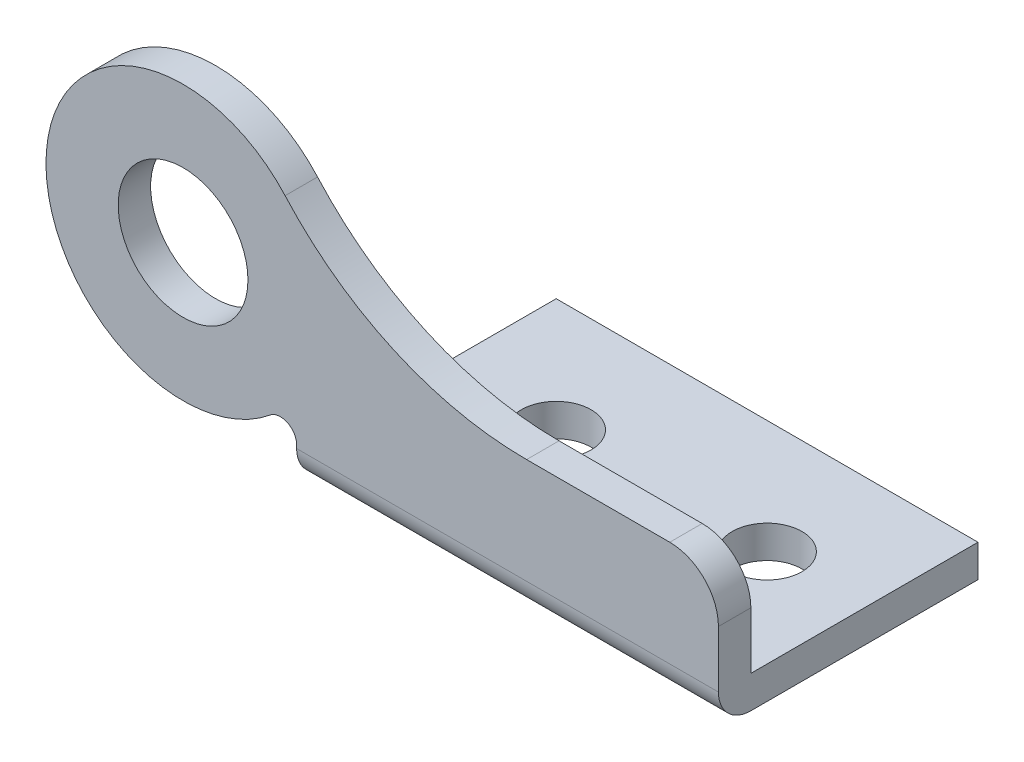
ISO-10303-21;
HEADER;
FILE_DESCRIPTION(('STEP AP214'),'2;1');
FILE_NAME('part.step','',(''),(''),'','','');
FILE_SCHEMA(('AUTOMOTIVE_DESIGN { 1 0 10303 214 1 1 1 1 }'));
ENDSEC;
DATA;
#1=APPLICATION_CONTEXT('core data for automotive mechanical design processes');
#2=APPLICATION_PROTOCOL_DEFINITION('international standard','automotive_design',2000,#1);
#3=PRODUCT_CONTEXT('',#1,'mechanical');
#4=PRODUCT('Part','Part','',(#3));
#5=PRODUCT_RELATED_PRODUCT_CATEGORY('part','',(#4));
#6=PRODUCT_DEFINITION_FORMATION('','',#4);
#7=PRODUCT_DEFINITION_CONTEXT('part definition',#1,'design');
#8=PRODUCT_DEFINITION('design','',#6,#7);
#9=PRODUCT_DEFINITION_SHAPE('','',#8);
#10=(LENGTH_UNIT() NAMED_UNIT(*) SI_UNIT(.MILLI.,.METRE.));
#11=(NAMED_UNIT(*) PLANE_ANGLE_UNIT() SI_UNIT($,.RADIAN.));
#12=(NAMED_UNIT(*) SI_UNIT($,.STERADIAN.) SOLID_ANGLE_UNIT());
#13=UNCERTAINTY_MEASURE_WITH_UNIT(LENGTH_MEASURE(1.E-05),#10,'distance_accuracy_value','');
#14=(GEOMETRIC_REPRESENTATION_CONTEXT(3) GLOBAL_UNCERTAINTY_ASSIGNED_CONTEXT((#13)) GLOBAL_UNIT_ASSIGNED_CONTEXT((#10,
#11,#12)) REPRESENTATION_CONTEXT('',''));
#15=CARTESIAN_POINT('',(0.,0.,0.));
#16=DIRECTION('',(0.,0.,1.));
#17=DIRECTION('',(1.,0.,0.));
#18=AXIS2_PLACEMENT_3D('',#15,#16,#17);
#19=CARTESIAN_POINT('',(0.,0.,0.));
#20=DIRECTION('',(0.,0.,1.));
#21=DIRECTION('',(1.,0.,0.));
#22=AXIS2_PLACEMENT_3D('',#19,#20,#21);
#23=PLANE('',#22);
#24=CARTESIAN_POINT('',(-11.3582479273434,0.248949506311803,0.));
#25=DIRECTION('',(0.,0.,1.));
#26=DIRECTION('',(1.,0.,0.));
#27=AXIS2_PLACEMENT_3D('',#24,#25,#26);
#28=CIRCLE('',#27,4.);
#29=CARTESIAN_POINT('',(-7.35824792734337,0.248949506311803,0.));
#30=VERTEX_POINT('',#29);
#31=EDGE_CURVE('E151',#30,#30,#28,.T.);
#32=ORIENTED_EDGE('',*,*,#31,.T.);
#33=EDGE_LOOP('',(#32));
#34=FACE_BOUND('',#33,.T.);
#35=DIRECTION('',(1.,0.,0.));
#36=VECTOR('',#35,1.);
#37=CARTESIAN_POINT('',(0.,-7.2510504936882,0.));
#38=LINE('',#37,#36);
#39=CARTESIAN_POINT('',(-4.35824792734337,-7.2510504936882,0.));
#40=VERTEX_POINT('',#39);
#41=CARTESIAN_POINT('',(21.6417520726575,-7.2510504936882,0.));
#42=VERTEX_POINT('',#41);
#43=EDGE_CURVE('E211',#40,#42,#38,.T.);
#44=ORIENTED_EDGE('',*,*,#43,.F.);
#45=DIRECTION('',(1.37632299420031E-12,-1.,0.));
#46=VECTOR('',#45,1.);
#47=CARTESIAN_POINT('',(-4.35824792735335,-5.99835683684225E-12,0.));
#48=LINE('',#47,#46);
#49=CARTESIAN_POINT('',(-4.35824792734365,-7.0519066078712,0.));
#50=VERTEX_POINT('',#49);
#51=EDGE_CURVE('E127',#50,#40,#48,.T.);
#52=ORIENTED_EDGE('',*,*,#51,.F.);
#53=CARTESIAN_POINT('',(-5.35824792734337,-7.0519066078712,0.));
#54=DIRECTION('',(0.,0.,1.));
#55=DIRECTION('',(1.,0.,0.));
#56=AXIS2_PLACEMENT_3D('',#53,#54,#55);
#57=CIRCLE('',#56,0.999999999999639);
#58=CARTESIAN_POINT('',(-5.993168562263,-6.27932924129065,0.));
#59=VERTEX_POINT('',#58);
#60=EDGE_CURVE('E183',#50,#59,#57,.T.);
#61=ORIENTED_EDGE('',*,*,#60,.T.);
#62=CARTESIAN_POINT('',(-11.3582479273424,0.24894950631167,0.));
#63=DIRECTION('',(0.,0.,1.));
#64=DIRECTION('',(1.,0.,0.));
#65=AXIS2_PLACEMENT_3D('',#62,#63,#64);
#66=CIRCLE('',#65,8.44999999999993);
#67=CARTESIAN_POINT('',(-5.06885901289107,5.8921832497229,0.));
#68=VERTEX_POINT('',#67);
#69=EDGE_CURVE('E180',#68,#59,#66,.T.);
#70=ORIENTED_EDGE('',*,*,#69,.F.);
#71=CARTESIAN_POINT('',(9.8172685952875,19.2489495063116,0.));
#72=DIRECTION('',(0.,0.,1.));
#73=DIRECTION('',(1.,0.,0.));
#74=AXIS2_PLACEMENT_3D('',#71,#72,#73);
#75=CIRCLE('',#74,20.0000000000031);
#76=CARTESIAN_POINT('',(9.8172685952875,-0.751050493691473,0.));
#77=VERTEX_POINT('',#76);
#78=EDGE_CURVE('E177',#68,#77,#75,.T.);
#79=ORIENTED_EDGE('',*,*,#78,.T.);
#80=DIRECTION('',(-1.,0.,0.));
#81=VECTOR('',#80,1.);
#82=CARTESIAN_POINT('',(0.,-0.751050493691473,0.));
#83=LINE('',#82,#81);
#84=CARTESIAN_POINT('',(18.6417520726575,-0.751050493691473,0.));
#85=VERTEX_POINT('',#84);
#86=EDGE_CURVE('E157',#85,#77,#83,.T.);
#87=ORIENTED_EDGE('',*,*,#86,.F.);
#88=CARTESIAN_POINT('',(18.6417520726575,-3.75105049369147,0.));
#89=DIRECTION('',(0.,0.,1.));
#90=DIRECTION('',(1.,0.,0.));
#91=AXIS2_PLACEMENT_3D('',#88,#89,#90);
#92=CIRCLE('',#91,3.);
#93=CARTESIAN_POINT('',(21.6417520726575,-3.75105049369147,0.));
#94=VERTEX_POINT('',#93);
#95=EDGE_CURVE('E189',#94,#85,#92,.T.);
#96=ORIENTED_EDGE('',*,*,#95,.F.);
#97=DIRECTION('',(0.,1.,0.));
#98=VECTOR('',#97,1.);
#99=CARTESIAN_POINT('',(21.6417520726575,0.,0.));
#100=LINE('',#99,#98);
#101=EDGE_CURVE('E187',#42,#94,#100,.T.);
#102=ORIENTED_EDGE('',*,*,#101,.F.);
#103=EDGE_LOOP('',(#44,#52,#61,#70,#79,#87,#96,#102));
#104=FACE_BOUND('',#103,.T.);
#105=ADVANCED_FACE('F39',(#34,#104),#23,.F.);
#106=CARTESIAN_POINT('',(9.8172685952875,19.2489495063116,2.));
#107=DIRECTION('',(0.,0.,-1.));
#108=DIRECTION('',(-1.,0.,0.));
#109=AXIS2_PLACEMENT_3D('',#106,#107,#108);
#110=CYLINDRICAL_SURFACE('',#109,20.0000000000031);
#111=ORIENTED_EDGE('',*,*,#78,.F.);
#112=DIRECTION('',(0.,0.,-1.));
#113=VECTOR('',#112,1.);
#114=CARTESIAN_POINT('',(-5.06885901289107,5.8921832497229,2.));
#115=LINE('',#114,#113);
#116=CARTESIAN_POINT('',(-5.06885901289107,5.8921832497229,2.));
#117=VERTEX_POINT('',#116);
#118=EDGE_CURVE('E209',#117,#68,#115,.T.);
#119=ORIENTED_EDGE('',*,*,#118,.F.);
#120=CARTESIAN_POINT('',(9.8172685952875,19.2489495063116,2.));
#121=DIRECTION('',(0.,0.,1.));
#122=DIRECTION('',(1.,0.,0.));
#123=AXIS2_PLACEMENT_3D('',#120,#121,#122);
#124=CIRCLE('',#123,20.0000000000031);
#125=CARTESIAN_POINT('',(9.8172685952875,-0.751050493691473,2.));
#126=VERTEX_POINT('',#125);
#127=EDGE_CURVE('E156',#117,#126,#124,.T.);
#128=ORIENTED_EDGE('',*,*,#127,.T.);
#129=DIRECTION('',(0.,0.,-1.));
#130=VECTOR('',#129,1.);
#131=CARTESIAN_POINT('',(9.8172685952875,-0.751050493691473,2.));
#132=LINE('',#131,#130);
#133=EDGE_CURVE('E174',#126,#77,#132,.T.);
#134=ORIENTED_EDGE('',*,*,#133,.T.);
#135=EDGE_LOOP('',(#111,#119,#128,#134));
#136=FACE_BOUND('',#135,.T.);
#137=ADVANCED_FACE('F242',(#136),#110,.F.);
#138=CARTESIAN_POINT('',(-11.3582479273424,0.24894950631167,2.));
#139=DIRECTION('',(0.,0.,-1.));
#140=DIRECTION('',(-1.,0.,0.));
#141=AXIS2_PLACEMENT_3D('',#138,#139,#140);
#142=CYLINDRICAL_SURFACE('',#141,8.44999999999993);
#143=ORIENTED_EDGE('',*,*,#69,.T.);
#144=DIRECTION('',(0.,0.,-1.));
#145=VECTOR('',#144,1.);
#146=CARTESIAN_POINT('',(-5.993168562263,-6.27932924129065,2.));
#147=LINE('',#146,#145);
#148=CARTESIAN_POINT('',(-5.993168562263,-6.27932924129065,2.));
#149=VERTEX_POINT('',#148);
#150=EDGE_CURVE('E207',#149,#59,#147,.T.);
#151=ORIENTED_EDGE('',*,*,#150,.F.);
#152=CARTESIAN_POINT('',(-11.3582479273424,0.24894950631167,2.));
#153=DIRECTION('',(0.,0.,1.));
#154=DIRECTION('',(1.,0.,0.));
#155=AXIS2_PLACEMENT_3D('',#152,#153,#154);
#156=CIRCLE('',#155,8.44999999999993);
#157=EDGE_CURVE('E160',#117,#149,#156,.T.);
#158=ORIENTED_EDGE('',*,*,#157,.F.);
#159=ORIENTED_EDGE('',*,*,#118,.T.);
#160=EDGE_LOOP('',(#143,#151,#158,#159));
#161=FACE_BOUND('',#160,.T.);
#162=ADVANCED_FACE('F245',(#161),#142,.T.);
#163=CARTESIAN_POINT('',(-5.35824792734337,-7.0519066078712,2.));
#164=DIRECTION('',(0.,0.,-1.));
#165=DIRECTION('',(-1.,0.,0.));
#166=AXIS2_PLACEMENT_3D('',#163,#164,#165);
#167=CYLINDRICAL_SURFACE('',#166,0.999999999999639);
#168=ORIENTED_EDGE('',*,*,#60,.F.);
#169=DIRECTION('',(0.,0.,-1.));
#170=VECTOR('',#169,1.);
#171=CARTESIAN_POINT('',(-4.35824792734365,-7.0519066078712,2.));
#172=LINE('',#171,#170);
#173=CARTESIAN_POINT('',(-4.35824792734365,-7.0519066078712,2.));
#174=VERTEX_POINT('',#173);
#175=EDGE_CURVE('E205',#174,#50,#172,.T.);
#176=ORIENTED_EDGE('',*,*,#175,.F.);
#177=CARTESIAN_POINT('',(-5.35824792734337,-7.0519066078712,2.));
#178=DIRECTION('',(0.,0.,1.));
#179=DIRECTION('',(1.,0.,0.));
#180=AXIS2_PLACEMENT_3D('',#177,#178,#179);
#181=CIRCLE('',#180,0.999999999999639);
#182=EDGE_CURVE('E162',#174,#149,#181,.T.);
#183=ORIENTED_EDGE('',*,*,#182,.T.);
#184=ORIENTED_EDGE('',*,*,#150,.T.);
#185=EDGE_LOOP('',(#168,#176,#183,#184));
#186=FACE_BOUND('',#185,.T.);
#187=ADVANCED_FACE('F248',(#186),#167,.F.);
#188=CARTESIAN_POINT('',(-4.35824792735335,-5.99835683684225E-12,2.));
#189=DIRECTION('',(1.,1.37632299420031E-12,0.));
#190=DIRECTION('',(-1.37632299420031E-12,1.,0.));
#191=AXIS2_PLACEMENT_3D('',#188,#189,#190);
#192=PLANE('',#191);
#193=DIRECTION('',(0.,0.,-1.));
#194=VECTOR('',#193,1.);
#195=CARTESIAN_POINT('',(-4.35824792734337,-9.2510504936882,2.));
#196=LINE('',#195,#194);
#197=CARTESIAN_POINT('',(-4.35824792734337,-9.2510504936882,0.));
#198=VERTEX_POINT('',#197);
#199=CARTESIAN_POINT('',(-4.35824792734337,-9.2510504936882,-14.));
#200=VERTEX_POINT('',#199);
#201=EDGE_CURVE('E203',#198,#200,#196,.T.);
#202=ORIENTED_EDGE('',*,*,#201,.F.);
#203=CARTESIAN_POINT('',(-4.35824792734337,-7.2510504936882,0.));
#204=DIRECTION('',(1.,1.37632299420031E-12,0.));
#205=DIRECTION('',(-1.37632299420031E-12,1.,0.));
#206=AXIS2_PLACEMENT_3D('',#203,#204,#205);
#207=CIRCLE('',#206,2.);
#208=CARTESIAN_POINT('',(-4.35824792734337,-7.2510504936882,2.));
#209=VERTEX_POINT('',#208);
#210=EDGE_CURVE('E61',#198,#209,#207,.F.);
#211=ORIENTED_EDGE('',*,*,#210,.T.);
#212=DIRECTION('',(1.37632299420031E-12,-1.,0.));
#213=VECTOR('',#212,1.);
#214=CARTESIAN_POINT('',(-4.35824792735335,-5.99835683684225E-12,2.));
#215=LINE('',#214,#213);
#216=EDGE_CURVE('E165',#174,#209,#215,.T.);
#217=ORIENTED_EDGE('',*,*,#216,.F.);
#218=ORIENTED_EDGE('',*,*,#175,.T.);
#219=ORIENTED_EDGE('',*,*,#51,.T.);
#220=DIRECTION('',(0.,0.,-1.));
#221=VECTOR('',#220,1.);
#222=CARTESIAN_POINT('',(-4.35824792734338,-7.2510504936882,2.));
#223=LINE('',#222,#221);
#224=CARTESIAN_POINT('',(-4.35824792734337,-7.2510504936882,-14.));
#225=VERTEX_POINT('',#224);
#226=EDGE_CURVE('E121',#40,#225,#223,.T.);
#227=ORIENTED_EDGE('',*,*,#226,.T.);
#228=DIRECTION('',(0.,-1.,0.));
#229=VECTOR('',#228,1.);
#230=CARTESIAN_POINT('',(-4.35824792734337,-7.2510504936882,-14.));
#231=LINE('',#230,#229);
#232=EDGE_CURVE('E124',#225,#200,#231,.T.);
#233=ORIENTED_EDGE('',*,*,#232,.T.);
#234=EDGE_LOOP('',(#202,#211,#217,#218,#219,#227,#233));
#235=FACE_BOUND('',#234,.T.);
#236=ADVANCED_FACE('F123',(#235),#192,.F.);
#237=CARTESIAN_POINT('',(0.,-9.2510504936882,2.));
#238=DIRECTION('',(0.,-1.,0.));
#239=DIRECTION('',(0.,0.,-1.));
#240=AXIS2_PLACEMENT_3D('',#237,#238,#239);
#241=PLANE('',#240);
#242=DIRECTION('',(0.,0.,-1.));
#243=VECTOR('',#242,1.);
#244=CARTESIAN_POINT('',(21.6417520726566,-9.2510504936882,2.));
#245=LINE('',#244,#243);
#246=CARTESIAN_POINT('',(21.6417520726566,-9.2510504936882,0.));
#247=VERTEX_POINT('',#246);
#248=CARTESIAN_POINT('',(21.6417520726566,-9.2510504936882,-14.));
#249=VERTEX_POINT('',#248);
#250=EDGE_CURVE('E201',#247,#249,#245,.T.);
#251=ORIENTED_EDGE('',*,*,#250,.F.);
#252=DIRECTION('',(-1.,0.,0.));
#253=VECTOR('',#252,1.);
#254=CARTESIAN_POINT('',(0.,-9.2510504936882,0.));
#255=LINE('',#254,#253);
#256=EDGE_CURVE('E213',#247,#198,#255,.T.);
#257=ORIENTED_EDGE('',*,*,#256,.T.);
#258=ORIENTED_EDGE('',*,*,#201,.T.);
#259=DIRECTION('',(1.,0.,0.));
#260=VECTOR('',#259,1.);
#261=CARTESIAN_POINT('',(-4.35824792734337,-9.2510504936882,-14.));
#262=LINE('',#261,#260);
#263=EDGE_CURVE('E132',#200,#249,#262,.T.);
#264=ORIENTED_EDGE('',*,*,#263,.T.);
#265=EDGE_LOOP('',(#251,#257,#258,#264));
#266=FACE_BOUND('',#265,.T.);
#267=CARTESIAN_POINT('',(2.64175207265662,-9.2510504936882,-7.));
#268=DIRECTION('',(0.,-1.,0.));
#269=DIRECTION('',(0.,0.,1.));
#270=AXIS2_PLACEMENT_3D('',#267,#268,#269);
#271=CIRCLE('',#270,2.15);
#272=CARTESIAN_POINT('',(2.64175207265662,-9.2510504936882,-4.85));
#273=VERTEX_POINT('',#272);
#274=EDGE_CURVE('E309',#273,#273,#271,.T.);
#275=ORIENTED_EDGE('',*,*,#274,.F.);
#276=EDGE_LOOP('',(#275));
#277=FACE_BOUND('',#276,.T.);
#278=CARTESIAN_POINT('',(15.6417520726566,-9.2510504936882,-7.));
#279=DIRECTION('',(0.,-1.,0.));
#280=DIRECTION('',(0.,0.,1.));
#281=AXIS2_PLACEMENT_3D('',#278,#279,#280);
#282=CIRCLE('',#281,2.15);
#283=CARTESIAN_POINT('',(15.6417520726566,-9.2510504936882,-4.85));
#284=VERTEX_POINT('',#283);
#285=EDGE_CURVE('E306',#284,#284,#282,.T.);
#286=ORIENTED_EDGE('',*,*,#285,.F.);
#287=EDGE_LOOP('',(#286));
#288=FACE_BOUND('',#287,.T.);
#289=ADVANCED_FACE('F219',(#266,#277,#288),#241,.T.);
#290=CARTESIAN_POINT('',(21.6417520726575,0.,2.));
#291=DIRECTION('',(-1.,0.,0.));
#292=DIRECTION('',(0.,0.,1.));
#293=AXIS2_PLACEMENT_3D('',#290,#291,#292);
#294=PLANE('',#293);
#295=DIRECTION('',(0.,1.,0.));
#296=VECTOR('',#295,1.);
#297=CARTESIAN_POINT('',(21.6417520726575,0.,2.));
#298=LINE('',#297,#296);
#299=CARTESIAN_POINT('',(21.6417520726575,-7.2510504936882,2.));
#300=VERTEX_POINT('',#299);
#301=CARTESIAN_POINT('',(21.6417520726575,-3.75105049369147,2.));
#302=VERTEX_POINT('',#301);
#303=EDGE_CURVE('E167',#300,#302,#298,.T.);
#304=ORIENTED_EDGE('',*,*,#303,.F.);
#305=CARTESIAN_POINT('',(21.6417520726575,-7.2510504936882,0.));
#306=DIRECTION('',(-1.,0.,0.));
#307=DIRECTION('',(0.,0.,1.));
#308=AXIS2_PLACEMENT_3D('',#305,#306,#307);
#309=CIRCLE('',#308,2.);
#310=EDGE_CURVE('E11',#300,#247,#309,.F.);
#311=ORIENTED_EDGE('',*,*,#310,.T.);
#312=ORIENTED_EDGE('',*,*,#250,.T.);
#313=DIRECTION('',(0.,-1.,0.));
#314=VECTOR('',#313,1.);
#315=CARTESIAN_POINT('',(21.6417520726566,-7.2510504936882,-14.));
#316=LINE('',#315,#314);
#317=CARTESIAN_POINT('',(21.6417520726566,-7.2510504936882,-14.));
#318=VERTEX_POINT('',#317);
#319=EDGE_CURVE('E140',#318,#249,#316,.T.);
#320=ORIENTED_EDGE('',*,*,#319,.F.);
#321=DIRECTION('',(0.,0.,1.));
#322=VECTOR('',#321,1.);
#323=CARTESIAN_POINT('',(21.6417520726566,-7.2510504936882,-14.));
#324=LINE('',#323,#322);
#325=EDGE_CURVE('E141',#318,#42,#324,.T.);
#326=ORIENTED_EDGE('',*,*,#325,.T.);
#327=ORIENTED_EDGE('',*,*,#101,.T.);
#328=DIRECTION('',(0.,0.,-1.));
#329=VECTOR('',#328,1.);
#330=CARTESIAN_POINT('',(21.6417520726575,-3.75105049369147,2.));
#331=LINE('',#330,#329);
#332=EDGE_CURVE('E198',#302,#94,#331,.T.);
#333=ORIENTED_EDGE('',*,*,#332,.F.);
#334=EDGE_LOOP('',(#304,#311,#312,#320,#326,#327,#333));
#335=FACE_BOUND('',#334,.T.);
#336=ADVANCED_FACE('F224',(#335),#294,.F.);
#337=CARTESIAN_POINT('',(18.6417520726575,-3.75105049369147,2.));
#338=DIRECTION('',(0.,0.,-1.));
#339=DIRECTION('',(-1.,0.,0.));
#340=AXIS2_PLACEMENT_3D('',#337,#338,#339);
#341=CYLINDRICAL_SURFACE('',#340,3.);
#342=ORIENTED_EDGE('',*,*,#95,.T.);
#343=DIRECTION('',(0.,0.,-1.));
#344=VECTOR('',#343,1.);
#345=CARTESIAN_POINT('',(18.6417520726575,-0.751050493691473,2.));
#346=LINE('',#345,#344);
#347=CARTESIAN_POINT('',(18.6417520726575,-0.751050493691473,2.));
#348=VERTEX_POINT('',#347);
#349=EDGE_CURVE('E195',#348,#85,#346,.T.);
#350=ORIENTED_EDGE('',*,*,#349,.F.);
#351=CARTESIAN_POINT('',(18.6417520726575,-3.75105049369147,2.));
#352=DIRECTION('',(0.,0.,1.));
#353=DIRECTION('',(1.,0.,0.));
#354=AXIS2_PLACEMENT_3D('',#351,#352,#353);
#355=CIRCLE('',#354,3.);
#356=EDGE_CURVE('E169',#302,#348,#355,.T.);
#357=ORIENTED_EDGE('',*,*,#356,.F.);
#358=ORIENTED_EDGE('',*,*,#332,.T.);
#359=EDGE_LOOP('',(#342,#350,#357,#358));
#360=FACE_BOUND('',#359,.T.);
#361=ADVANCED_FACE('F231',(#360),#341,.T.);
#362=CARTESIAN_POINT('',(-11.3582479273434,0.248949506311803,2.));
#363=DIRECTION('',(0.,0.,-1.));
#364=DIRECTION('',(-1.,0.,0.));
#365=AXIS2_PLACEMENT_3D('',#362,#363,#364);
#366=CYLINDRICAL_SURFACE('',#365,4.);
#367=CARTESIAN_POINT('',(-11.3582479273434,0.248949506311803,2.));
#368=DIRECTION('',(0.,0.,1.));
#369=DIRECTION('',(1.,0.,0.));
#370=AXIS2_PLACEMENT_3D('',#367,#368,#369);
#371=CIRCLE('',#370,4.);
#372=CARTESIAN_POINT('',(-7.35824792734337,0.248949506311803,2.));
#373=VERTEX_POINT('',#372);
#374=EDGE_CURVE('E153',#373,#373,#371,.T.);
#375=ORIENTED_EDGE('',*,*,#374,.T.);
#376=EDGE_LOOP('',(#375));
#377=FACE_BOUND('',#376,.T.);
#378=ORIENTED_EDGE('',*,*,#31,.F.);
#379=EDGE_LOOP('',(#378));
#380=FACE_BOUND('',#379,.T.);
#381=ADVANCED_FACE('F262',(#377,#380),#366,.F.);
#382=CARTESIAN_POINT('',(0.,-0.751050493691473,2.));
#383=DIRECTION('',(0.,-1.,0.));
#384=DIRECTION('',(0.,0.,-1.));
#385=AXIS2_PLACEMENT_3D('',#382,#383,#384);
#386=PLANE('',#385);
#387=ORIENTED_EDGE('',*,*,#86,.T.);
#388=ORIENTED_EDGE('',*,*,#133,.F.);
#389=DIRECTION('',(-1.,0.,0.));
#390=VECTOR('',#389,1.);
#391=CARTESIAN_POINT('',(0.,-0.751050493691473,2.));
#392=LINE('',#391,#390);
#393=EDGE_CURVE('E172',#348,#126,#392,.T.);
#394=ORIENTED_EDGE('',*,*,#393,.F.);
#395=ORIENTED_EDGE('',*,*,#349,.T.);
#396=EDGE_LOOP('',(#387,#388,#394,#395));
#397=FACE_BOUND('',#396,.T.);
#398=ADVANCED_FACE('F234',(#397),#386,.F.);
#399=CARTESIAN_POINT('',(0.,0.,2.));
#400=DIRECTION('',(0.,0.,1.));
#401=DIRECTION('',(1.,0.,0.));
#402=AXIS2_PLACEMENT_3D('',#399,#400,#401);
#403=PLANE('',#402);
#404=ORIENTED_EDGE('',*,*,#216,.T.);
#405=DIRECTION('',(-1.,0.,0.));
#406=VECTOR('',#405,1.);
#407=CARTESIAN_POINT('',(0.,-7.2510504936882,2.));
#408=LINE('',#407,#406);
#409=EDGE_CURVE('E47',#209,#300,#408,.F.);
#410=ORIENTED_EDGE('',*,*,#409,.T.);
#411=ORIENTED_EDGE('',*,*,#303,.T.);
#412=ORIENTED_EDGE('',*,*,#356,.T.);
#413=ORIENTED_EDGE('',*,*,#393,.T.);
#414=ORIENTED_EDGE('',*,*,#127,.F.);
#415=ORIENTED_EDGE('',*,*,#157,.T.);
#416=ORIENTED_EDGE('',*,*,#182,.F.);
#417=EDGE_LOOP('',(#404,#410,#411,#412,#413,#414,#415,#416));
#418=FACE_BOUND('',#417,.T.);
#419=ORIENTED_EDGE('',*,*,#374,.F.);
#420=EDGE_LOOP('',(#419));
#421=FACE_BOUND('',#420,.T.);
#422=ADVANCED_FACE('F227',(#418,#421),#403,.T.);
#423=CARTESIAN_POINT('',(0.,-7.2510504936882,0.));
#424=DIRECTION('',(0.,-1.,0.));
#425=DIRECTION('',(0.,0.,-1.));
#426=AXIS2_PLACEMENT_3D('',#423,#424,#425);
#427=PLANE('',#426);
#428=CARTESIAN_POINT('',(15.6417520726566,-7.2510504936882,-7.));
#429=DIRECTION('',(0.,-1.,0.));
#430=DIRECTION('',(0.,0.,1.));
#431=AXIS2_PLACEMENT_3D('',#428,#429,#430);
#432=CIRCLE('',#431,2.15);
#433=CARTESIAN_POINT('',(15.6417520726566,-7.2510504936882,-4.85));
#434=VERTEX_POINT('',#433);
#435=EDGE_CURVE('E308',#434,#434,#432,.T.);
#436=ORIENTED_EDGE('',*,*,#435,.T.);
#437=EDGE_LOOP('',(#436));
#438=FACE_BOUND('',#437,.T.);
#439=CARTESIAN_POINT('',(2.64175207265662,-7.2510504936882,-7.));
#440=DIRECTION('',(0.,-1.,0.));
#441=DIRECTION('',(0.,0.,1.));
#442=AXIS2_PLACEMENT_3D('',#439,#440,#441);
#443=CIRCLE('',#442,2.15);
#444=CARTESIAN_POINT('',(2.64175207265662,-7.2510504936882,-4.85));
#445=VERTEX_POINT('',#444);
#446=EDGE_CURVE('E150',#445,#445,#443,.T.);
#447=ORIENTED_EDGE('',*,*,#446,.T.);
#448=EDGE_LOOP('',(#447));
#449=FACE_BOUND('',#448,.T.);
#450=ORIENTED_EDGE('',*,*,#226,.F.);
#451=ORIENTED_EDGE('',*,*,#43,.T.);
#452=ORIENTED_EDGE('',*,*,#325,.F.);
#453=DIRECTION('',(1.,0.,0.));
#454=VECTOR('',#453,1.);
#455=CARTESIAN_POINT('',(-4.35824792734337,-7.2510504936882,-14.));
#456=LINE('',#455,#454);
#457=EDGE_CURVE('E131',#225,#318,#456,.T.);
#458=ORIENTED_EDGE('',*,*,#457,.F.);
#459=EDGE_LOOP('',(#450,#451,#452,#458));
#460=FACE_BOUND('',#459,.T.);
#461=ADVANCED_FACE('F143',(#438,#449,#460),#427,.F.);
#462=CARTESIAN_POINT('',(-4.35824792734337,-7.2510504936882,-14.));
#463=DIRECTION('',(0.,0.,-1.));
#464=DIRECTION('',(-1.,0.,0.));
#465=AXIS2_PLACEMENT_3D('',#462,#463,#464);
#466=PLANE('',#465);
#467=ORIENTED_EDGE('',*,*,#263,.F.);
#468=ORIENTED_EDGE('',*,*,#232,.F.);
#469=ORIENTED_EDGE('',*,*,#457,.T.);
#470=ORIENTED_EDGE('',*,*,#319,.T.);
#471=EDGE_LOOP('',(#467,#468,#469,#470));
#472=FACE_BOUND('',#471,.T.);
#473=ADVANCED_FACE('F136',(#472),#466,.T.);
#474=CARTESIAN_POINT('',(2.64175207265662,-7.2510504936882,-7.));
#475=DIRECTION('',(0.,-1.,0.));
#476=DIRECTION('',(0.,0.,-1.));
#477=AXIS2_PLACEMENT_3D('',#474,#475,#476);
#478=CYLINDRICAL_SURFACE('',#477,2.15);
#479=ORIENTED_EDGE('',*,*,#446,.F.);
#480=EDGE_LOOP('',(#479));
#481=FACE_BOUND('',#480,.T.);
#482=ORIENTED_EDGE('',*,*,#274,.T.);
#483=EDGE_LOOP('',(#482));
#484=FACE_BOUND('',#483,.T.);
#485=ADVANCED_FACE('F290',(#481,#484),#478,.F.);
#486=CARTESIAN_POINT('',(15.6417520726566,-7.2510504936882,-7.));
#487=DIRECTION('',(0.,-1.,0.));
#488=DIRECTION('',(0.,0.,-1.));
#489=AXIS2_PLACEMENT_3D('',#486,#487,#488);
#490=CYLINDRICAL_SURFACE('',#489,2.15);
#491=ORIENTED_EDGE('',*,*,#285,.T.);
#492=EDGE_LOOP('',(#491));
#493=FACE_BOUND('',#492,.T.);
#494=ORIENTED_EDGE('',*,*,#435,.F.);
#495=EDGE_LOOP('',(#494));
#496=FACE_BOUND('',#495,.T.);
#497=ADVANCED_FACE('F296',(#493,#496),#490,.F.);
#498=CARTESIAN_POINT('',(0.,-7.2510504936882,0.));
#499=DIRECTION('',(-1.,0.,0.));
#500=DIRECTION('',(0.,0.,1.));
#501=AXIS2_PLACEMENT_3D('',#498,#499,#500);
#502=CYLINDRICAL_SURFACE('',#501,2.);
#503=ORIENTED_EDGE('',*,*,#310,.F.);
#504=ORIENTED_EDGE('',*,*,#409,.F.);
#505=ORIENTED_EDGE('',*,*,#210,.F.);
#506=ORIENTED_EDGE('',*,*,#256,.F.);
#507=EDGE_LOOP('',(#503,#504,#505,#506));
#508=FACE_BOUND('',#507,.T.);
#509=ADVANCED_FACE('F41',(#508),#502,.T.);
#510=CLOSED_SHELL('',(#105,#137,#162,#187,#236,#289,#336,#361,#381,#398,#422,#461,#473,#485,
#497,#509));
#511=MANIFOLD_SOLID_BREP('B2',#510);
#512=ADVANCED_BREP_SHAPE_REPRESENTATION('',(#18,#511),#14);
#513=SHAPE_DEFINITION_REPRESENTATION(#9,#512);
ENDSEC;
END-ISO-10303-21;
